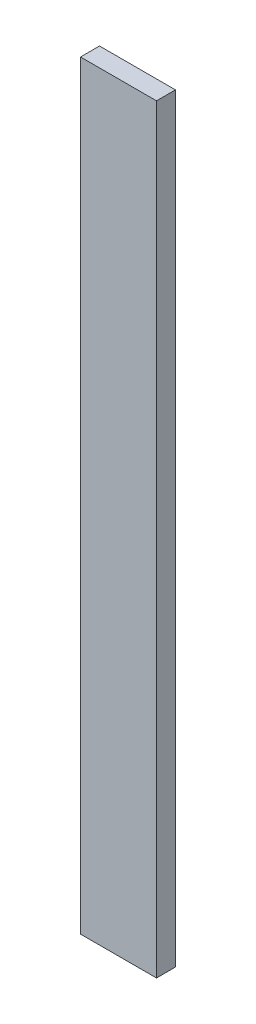
ISO-10303-21;
HEADER;
FILE_DESCRIPTION(('STEP AP214'),'2;1');
FILE_NAME('part.step','',(''),(''),'','','');
FILE_SCHEMA(('AUTOMOTIVE_DESIGN { 1 0 10303 214 1 1 1 1 }'));
ENDSEC;
DATA;
#1=APPLICATION_CONTEXT('core data for automotive mechanical design processes');
#2=APPLICATION_PROTOCOL_DEFINITION('international standard','automotive_design',2000,#1);
#3=PRODUCT_CONTEXT('',#1,'mechanical');
#4=PRODUCT('Part','Part','',(#3));
#5=PRODUCT_RELATED_PRODUCT_CATEGORY('part','',(#4));
#6=PRODUCT_DEFINITION_FORMATION('','',#4);
#7=PRODUCT_DEFINITION_CONTEXT('part definition',#1,'design');
#8=PRODUCT_DEFINITION('design','',#6,#7);
#9=PRODUCT_DEFINITION_SHAPE('','',#8);
#10=(LENGTH_UNIT() NAMED_UNIT(*) SI_UNIT(.MILLI.,.METRE.));
#11=(NAMED_UNIT(*) PLANE_ANGLE_UNIT() SI_UNIT($,.RADIAN.));
#12=(NAMED_UNIT(*) SI_UNIT($,.STERADIAN.) SOLID_ANGLE_UNIT());
#13=UNCERTAINTY_MEASURE_WITH_UNIT(LENGTH_MEASURE(1.E-05),#10,'distance_accuracy_value','');
#14=(GEOMETRIC_REPRESENTATION_CONTEXT(3) GLOBAL_UNCERTAINTY_ASSIGNED_CONTEXT((#13)) GLOBAL_UNIT_ASSIGNED_CONTEXT((#10,
#11,#12)) REPRESENTATION_CONTEXT('',''));
#15=CARTESIAN_POINT('',(0.,0.,0.));
#16=DIRECTION('',(0.,0.,1.));
#17=DIRECTION('',(1.,0.,0.));
#18=AXIS2_PLACEMENT_3D('',#15,#16,#17);
#19=CARTESIAN_POINT('',(0.,0.,3.175));
#20=DIRECTION('',(1.,0.,0.));
#21=DIRECTION('',(0.,0.,-1.));
#22=AXIS2_PLACEMENT_3D('',#19,#20,#21);
#23=PLANE('',#22);
#24=DIRECTION('',(0.,-1.,0.));
#25=VECTOR('',#24,1.);
#26=CARTESIAN_POINT('',(0.,0.,0.));
#27=LINE('',#26,#25);
#28=CARTESIAN_POINT('',(0.,0.,0.));
#29=VERTEX_POINT('',#28);
#30=CARTESIAN_POINT('',(0.,-127.,0.));
#31=VERTEX_POINT('',#30);
#32=EDGE_CURVE('E107',#29,#31,#27,.T.);
#33=ORIENTED_EDGE('',*,*,#32,.T.);
#34=DIRECTION('',(0.,0.,-1.));
#35=VECTOR('',#34,1.);
#36=CARTESIAN_POINT('',(0.,-127.,3.175));
#37=LINE('',#36,#35);
#38=CARTESIAN_POINT('',(0.,-127.,3.175));
#39=VERTEX_POINT('',#38);
#40=EDGE_CURVE('E11',#39,#31,#37,.T.);
#41=ORIENTED_EDGE('',*,*,#40,.F.);
#42=DIRECTION('',(0.,-1.,0.));
#43=VECTOR('',#42,1.);
#44=CARTESIAN_POINT('',(0.,0.,3.175));
#45=LINE('',#44,#43);
#46=CARTESIAN_POINT('',(0.,0.,3.175));
#47=VERTEX_POINT('',#46);
#48=EDGE_CURVE('E91',#47,#39,#45,.T.);
#49=ORIENTED_EDGE('',*,*,#48,.F.);
#50=DIRECTION('',(0.,0.,-1.));
#51=VECTOR('',#50,1.);
#52=CARTESIAN_POINT('',(0.,0.,3.175));
#53=LINE('',#52,#51);
#54=EDGE_CURVE('E103',#47,#29,#53,.T.);
#55=ORIENTED_EDGE('',*,*,#54,.T.);
#56=EDGE_LOOP('',(#33,#41,#49,#55));
#57=FACE_BOUND('',#56,.T.);
#58=ADVANCED_FACE('F39',(#57),#23,.F.);
#59=CARTESIAN_POINT('',(0.,-127.,3.175));
#60=DIRECTION('',(0.,1.,0.));
#61=DIRECTION('',(0.,0.,1.));
#62=AXIS2_PLACEMENT_3D('',#59,#60,#61);
#63=PLANE('',#62);
#64=DIRECTION('',(1.,0.,0.));
#65=VECTOR('',#64,1.);
#66=CARTESIAN_POINT('',(0.,-127.,0.));
#67=LINE('',#66,#65);
#68=CARTESIAN_POINT('',(12.7,-127.,0.));
#69=VERTEX_POINT('',#68);
#70=EDGE_CURVE('E96',#31,#69,#67,.T.);
#71=ORIENTED_EDGE('',*,*,#70,.T.);
#72=DIRECTION('',(0.,0.,-1.));
#73=VECTOR('',#72,1.);
#74=CARTESIAN_POINT('',(12.7,-127.,3.175));
#75=LINE('',#74,#73);
#76=CARTESIAN_POINT('',(12.7,-127.,3.175));
#77=VERTEX_POINT('',#76);
#78=EDGE_CURVE('E48',#77,#69,#75,.T.);
#79=ORIENTED_EDGE('',*,*,#78,.F.);
#80=DIRECTION('',(1.,0.,0.));
#81=VECTOR('',#80,1.);
#82=CARTESIAN_POINT('',(0.,-127.,3.175));
#83=LINE('',#82,#81);
#84=EDGE_CURVE('E86',#39,#77,#83,.T.);
#85=ORIENTED_EDGE('',*,*,#84,.F.);
#86=ORIENTED_EDGE('',*,*,#40,.T.);
#87=EDGE_LOOP('',(#71,#79,#85,#86));
#88=FACE_BOUND('',#87,.T.);
#89=ADVANCED_FACE('F95',(#88),#63,.F.);
#90=CARTESIAN_POINT('',(12.7,0.,3.175));
#91=DIRECTION('',(-1.,0.,0.));
#92=DIRECTION('',(0.,-1.,0.));
#93=AXIS2_PLACEMENT_3D('',#90,#91,#92);
#94=PLANE('',#93);
#95=DIRECTION('',(0.,1.,0.));
#96=VECTOR('',#95,1.);
#97=CARTESIAN_POINT('',(12.7,0.,0.));
#98=LINE('',#97,#96);
#99=CARTESIAN_POINT('',(12.7,0.,0.));
#100=VERTEX_POINT('',#99);
#101=EDGE_CURVE('E73',#69,#100,#98,.T.);
#102=ORIENTED_EDGE('',*,*,#101,.T.);
#103=DIRECTION('',(0.,0.,-1.));
#104=VECTOR('',#103,1.);
#105=CARTESIAN_POINT('',(12.7,0.,3.175));
#106=LINE('',#105,#104);
#107=CARTESIAN_POINT('',(12.7,0.,3.175));
#108=VERTEX_POINT('',#107);
#109=EDGE_CURVE('E98',#108,#100,#106,.T.);
#110=ORIENTED_EDGE('',*,*,#109,.F.);
#111=DIRECTION('',(0.,1.,0.));
#112=VECTOR('',#111,1.);
#113=CARTESIAN_POINT('',(12.7,0.,3.175));
#114=LINE('',#113,#112);
#115=EDGE_CURVE('E89',#77,#108,#114,.T.);
#116=ORIENTED_EDGE('',*,*,#115,.F.);
#117=ORIENTED_EDGE('',*,*,#78,.T.);
#118=EDGE_LOOP('',(#102,#110,#116,#117));
#119=FACE_BOUND('',#118,.T.);
#120=ADVANCED_FACE('F99',(#119),#94,.F.);
#121=CARTESIAN_POINT('',(0.,0.,3.175));
#122=DIRECTION('',(0.,-1.,0.));
#123=DIRECTION('',(0.,0.,-1.));
#124=AXIS2_PLACEMENT_3D('',#121,#122,#123);
#125=PLANE('',#124);
#126=DIRECTION('',(-1.,0.,0.));
#127=VECTOR('',#126,1.);
#128=CARTESIAN_POINT('',(0.,0.,0.));
#129=LINE('',#128,#127);
#130=EDGE_CURVE('E79',#100,#29,#129,.T.);
#131=ORIENTED_EDGE('',*,*,#130,.T.);
#132=ORIENTED_EDGE('',*,*,#54,.F.);
#133=DIRECTION('',(-1.,0.,0.));
#134=VECTOR('',#133,1.);
#135=CARTESIAN_POINT('',(0.,0.,3.175));
#136=LINE('',#135,#134);
#137=EDGE_CURVE('E56',#108,#47,#136,.T.);
#138=ORIENTED_EDGE('',*,*,#137,.F.);
#139=ORIENTED_EDGE('',*,*,#109,.T.);
#140=EDGE_LOOP('',(#131,#132,#138,#139));
#141=FACE_BOUND('',#140,.T.);
#142=ADVANCED_FACE('F120',(#141),#125,.F.);
#143=CARTESIAN_POINT('',(0.,0.,3.175));
#144=DIRECTION('',(0.,0.,1.));
#145=DIRECTION('',(1.,0.,0.));
#146=AXIS2_PLACEMENT_3D('',#143,#144,#145);
#147=PLANE('',#146);
#148=ORIENTED_EDGE('',*,*,#48,.T.);
#149=ORIENTED_EDGE('',*,*,#84,.T.);
#150=ORIENTED_EDGE('',*,*,#115,.T.);
#151=ORIENTED_EDGE('',*,*,#137,.T.);
#152=EDGE_LOOP('',(#148,#149,#150,#151));
#153=FACE_BOUND('',#152,.T.);
#154=ADVANCED_FACE('F87',(#153),#147,.T.);
#155=CARTESIAN_POINT('',(0.,0.,0.));
#156=DIRECTION('',(0.,0.,1.));
#157=DIRECTION('',(1.,0.,0.));
#158=AXIS2_PLACEMENT_3D('',#155,#156,#157);
#159=PLANE('',#158);
#160=ORIENTED_EDGE('',*,*,#32,.F.);
#161=ORIENTED_EDGE('',*,*,#130,.F.);
#162=ORIENTED_EDGE('',*,*,#101,.F.);
#163=ORIENTED_EDGE('',*,*,#70,.F.);
#164=EDGE_LOOP('',(#160,#161,#162,#163));
#165=FACE_BOUND('',#164,.T.);
#166=ADVANCED_FACE('F123',(#165),#159,.F.);
#167=CLOSED_SHELL('',(#58,#89,#120,#142,#154,#166));
#168=MANIFOLD_SOLID_BREP('B2',#167);
#169=ADVANCED_BREP_SHAPE_REPRESENTATION('',(#18,#168),#14);
#170=SHAPE_DEFINITION_REPRESENTATION(#9,#169);
ENDSEC;
END-ISO-10303-21;
